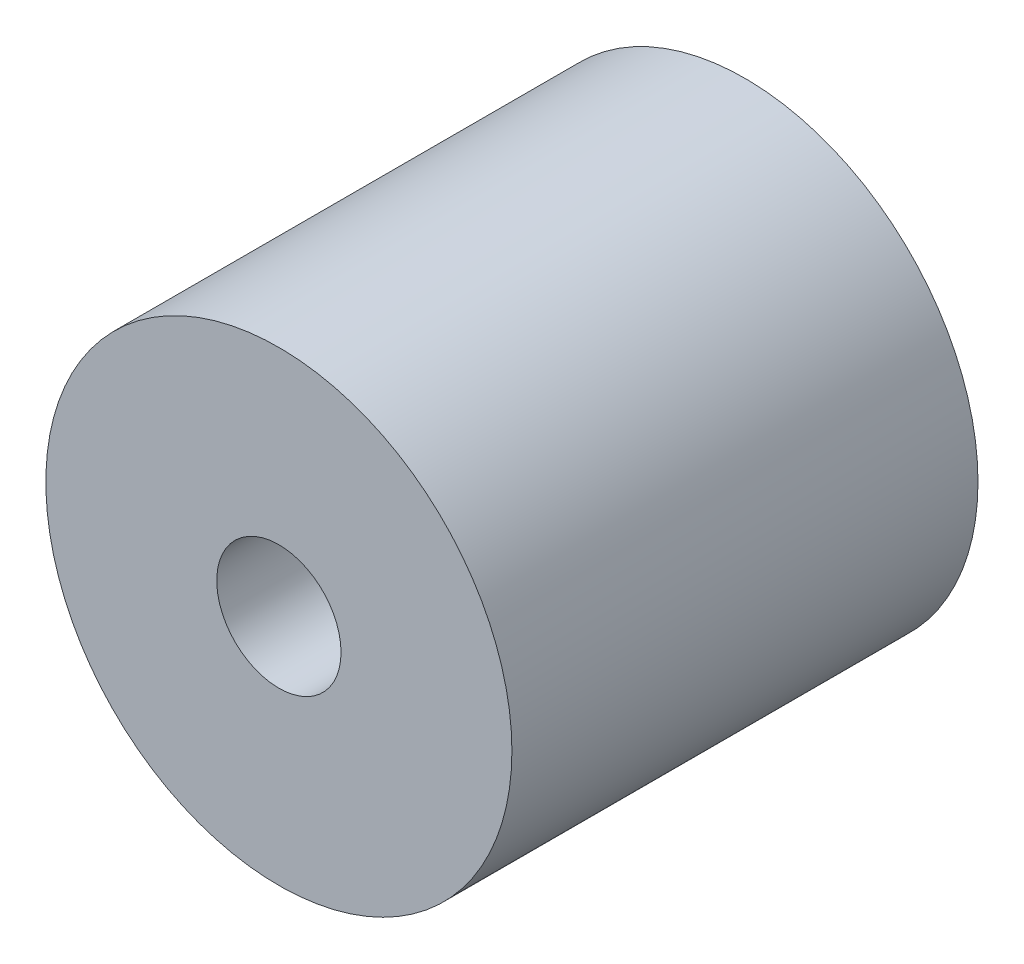
ISO-10303-21;
HEADER;
FILE_DESCRIPTION(('STEP AP214'),'2;1');
FILE_NAME('part.step','',(''),(''),'','','');
FILE_SCHEMA(('AUTOMOTIVE_DESIGN { 1 0 10303 214 1 1 1 1 }'));
ENDSEC;
DATA;
#1=APPLICATION_CONTEXT('core data for automotive mechanical design processes');
#2=APPLICATION_PROTOCOL_DEFINITION('international standard','automotive_design',2000,#1);
#3=PRODUCT_CONTEXT('',#1,'mechanical');
#4=PRODUCT('Part','Part','',(#3));
#5=PRODUCT_RELATED_PRODUCT_CATEGORY('part','',(#4));
#6=PRODUCT_DEFINITION_FORMATION('','',#4);
#7=PRODUCT_DEFINITION_CONTEXT('part definition',#1,'design');
#8=PRODUCT_DEFINITION('design','',#6,#7);
#9=PRODUCT_DEFINITION_SHAPE('','',#8);
#10=(LENGTH_UNIT() NAMED_UNIT(*) SI_UNIT(.MILLI.,.METRE.));
#11=(NAMED_UNIT(*) PLANE_ANGLE_UNIT() SI_UNIT($,.RADIAN.));
#12=(NAMED_UNIT(*) SI_UNIT($,.STERADIAN.) SOLID_ANGLE_UNIT());
#13=UNCERTAINTY_MEASURE_WITH_UNIT(LENGTH_MEASURE(1.E-05),#10,'distance_accuracy_value','');
#14=(GEOMETRIC_REPRESENTATION_CONTEXT(3) GLOBAL_UNCERTAINTY_ASSIGNED_CONTEXT((#13)) GLOBAL_UNIT_ASSIGNED_CONTEXT((#10,
#11,#12)) REPRESENTATION_CONTEXT('',''));
#15=CARTESIAN_POINT('',(0.,0.,0.));
#16=DIRECTION('',(0.,0.,1.));
#17=DIRECTION('',(1.,0.,0.));
#18=AXIS2_PLACEMENT_3D('',#15,#16,#17);
#19=CARTESIAN_POINT('',(0.,0.,300.));
#20=DIRECTION('',(0.,0.,1.));
#21=DIRECTION('',(1.,0.,0.));
#22=AXIS2_PLACEMENT_3D('',#19,#20,#21);
#23=PLANE('',#22);
#24=CARTESIAN_POINT('',(0.,0.,300.));
#25=DIRECTION('',(0.,0.,1.));
#26=DIRECTION('',(1.,0.,0.));
#27=AXIS2_PLACEMENT_3D('',#24,#25,#26);
#28=CIRCLE('',#27,150.);
#29=CARTESIAN_POINT('',(150.,0.,300.));
#30=VERTEX_POINT('',#29);
#31=EDGE_CURVE('E10',#30,#30,#28,.T.);
#32=ORIENTED_EDGE('',*,*,#31,.T.);
#33=EDGE_LOOP('',(#32));
#34=FACE_BOUND('',#33,.T.);
#35=CARTESIAN_POINT('',(0.,0.,300.));
#36=DIRECTION('',(0.,0.,1.));
#37=DIRECTION('',(1.,0.,0.));
#38=AXIS2_PLACEMENT_3D('',#35,#36,#37);
#39=CIRCLE('',#38,40.);
#40=CARTESIAN_POINT('',(40.,0.,300.));
#41=VERTEX_POINT('',#40);
#42=EDGE_CURVE('E56',#41,#41,#39,.T.);
#43=ORIENTED_EDGE('',*,*,#42,.F.);
#44=EDGE_LOOP('',(#43));
#45=FACE_BOUND('',#44,.T.);
#46=ADVANCED_FACE('F43',(#34,#45),#23,.T.);
#47=CARTESIAN_POINT('',(0.,0.,0.));
#48=DIRECTION('',(0.,0.,1.));
#49=DIRECTION('',(1.,0.,0.));
#50=AXIS2_PLACEMENT_3D('',#47,#48,#49);
#51=PLANE('',#50);
#52=CARTESIAN_POINT('',(0.,0.,0.));
#53=DIRECTION('',(0.,0.,1.));
#54=DIRECTION('',(1.,0.,0.));
#55=AXIS2_PLACEMENT_3D('',#52,#53,#54);
#56=CIRCLE('',#55,150.);
#57=CARTESIAN_POINT('',(150.,0.,0.));
#58=VERTEX_POINT('',#57);
#59=EDGE_CURVE('E47',#58,#58,#56,.T.);
#60=ORIENTED_EDGE('',*,*,#59,.F.);
#61=EDGE_LOOP('',(#60));
#62=FACE_BOUND('',#61,.T.);
#63=CARTESIAN_POINT('',(0.,0.,0.));
#64=DIRECTION('',(0.,0.,1.));
#65=DIRECTION('',(1.,0.,0.));
#66=AXIS2_PLACEMENT_3D('',#63,#64,#65);
#67=CIRCLE('',#66,40.);
#68=CARTESIAN_POINT('',(40.,0.,0.));
#69=VERTEX_POINT('',#68);
#70=EDGE_CURVE('E58',#69,#69,#67,.T.);
#71=ORIENTED_EDGE('',*,*,#70,.T.);
#72=EDGE_LOOP('',(#71));
#73=FACE_BOUND('',#72,.T.);
#74=ADVANCED_FACE('F70',(#62,#73),#51,.F.);
#75=CARTESIAN_POINT('',(0.,0.,300.));
#76=DIRECTION('',(0.,0.,-1.));
#77=DIRECTION('',(-1.,0.,0.));
#78=AXIS2_PLACEMENT_3D('',#75,#76,#77);
#79=CYLINDRICAL_SURFACE('',#78,150.);
#80=ORIENTED_EDGE('',*,*,#31,.F.);
#81=EDGE_LOOP('',(#80));
#82=FACE_BOUND('',#81,.T.);
#83=ORIENTED_EDGE('',*,*,#59,.T.);
#84=EDGE_LOOP('',(#83));
#85=FACE_BOUND('',#84,.T.);
#86=ADVANCED_FACE('F45',(#82,#85),#79,.T.);
#87=CARTESIAN_POINT('',(0.,0.,300.));
#88=DIRECTION('',(0.,0.,-1.));
#89=DIRECTION('',(-1.,0.,0.));
#90=AXIS2_PLACEMENT_3D('',#87,#88,#89);
#91=CYLINDRICAL_SURFACE('',#90,40.);
#92=ORIENTED_EDGE('',*,*,#42,.T.);
#93=EDGE_LOOP('',(#92));
#94=FACE_BOUND('',#93,.T.);
#95=ORIENTED_EDGE('',*,*,#70,.F.);
#96=EDGE_LOOP('',(#95));
#97=FACE_BOUND('',#96,.T.);
#98=ADVANCED_FACE('F66',(#94,#97),#91,.F.);
#99=CLOSED_SHELL('',(#46,#74,#86,#98));
#100=MANIFOLD_SOLID_BREP('B2',#99);
#101=ADVANCED_BREP_SHAPE_REPRESENTATION('',(#18,#100),#14);
#102=SHAPE_DEFINITION_REPRESENTATION(#9,#101);
ENDSEC;
END-ISO-10303-21;
